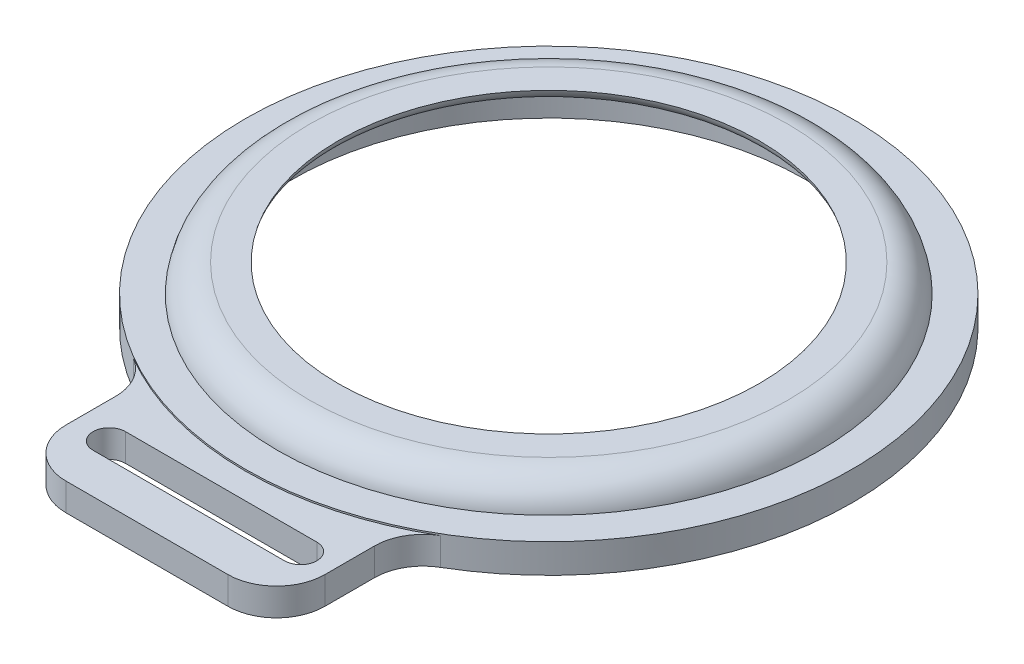
ISO-10303-21;
HEADER;
FILE_DESCRIPTION(('STEP AP214'),'2;1');
FILE_NAME('part.step','',(''),(''),'','','');
FILE_SCHEMA(('AUTOMOTIVE_DESIGN { 1 0 10303 214 1 1 1 1 }'));
ENDSEC;
DATA;
#1=APPLICATION_CONTEXT('core data for automotive mechanical design processes');
#2=APPLICATION_PROTOCOL_DEFINITION('international standard','automotive_design',2000,#1);
#3=PRODUCT_CONTEXT('',#1,'mechanical');
#4=PRODUCT('Part','Part','',(#3));
#5=PRODUCT_RELATED_PRODUCT_CATEGORY('part','',(#4));
#6=PRODUCT_DEFINITION_FORMATION('','',#4);
#7=PRODUCT_DEFINITION_CONTEXT('part definition',#1,'design');
#8=PRODUCT_DEFINITION('design','',#6,#7);
#9=PRODUCT_DEFINITION_SHAPE('','',#8);
#10=(LENGTH_UNIT() NAMED_UNIT(*) SI_UNIT(.MILLI.,.METRE.));
#11=(NAMED_UNIT(*) PLANE_ANGLE_UNIT() SI_UNIT($,.RADIAN.));
#12=(NAMED_UNIT(*) SI_UNIT($,.STERADIAN.) SOLID_ANGLE_UNIT());
#13=UNCERTAINTY_MEASURE_WITH_UNIT(LENGTH_MEASURE(1.E-05),#10,'distance_accuracy_value','');
#14=(GEOMETRIC_REPRESENTATION_CONTEXT(3) GLOBAL_UNCERTAINTY_ASSIGNED_CONTEXT((#13)) GLOBAL_UNIT_ASSIGNED_CONTEXT((#10,
#11,#12)) REPRESENTATION_CONTEXT('',''));
#15=CARTESIAN_POINT('',(0.,0.,0.));
#16=DIRECTION('',(0.,0.,1.));
#17=DIRECTION('',(1.,0.,0.));
#18=AXIS2_PLACEMENT_3D('',#15,#16,#17);
#19=CARTESIAN_POINT('',(0.,1.8,0.));
#20=DIRECTION('',(0.,-1.,0.));
#21=DIRECTION('',(0.,0.,-1.));
#22=AXIS2_PLACEMENT_3D('',#19,#20,#21);
#23=CYLINDRICAL_SURFACE('',#22,18.75);
#24=CARTESIAN_POINT('',(0.,1.8,0.));
#25=DIRECTION('',(0.,1.,0.));
#26=DIRECTION('',(0.,0.,1.));
#27=AXIS2_PLACEMENT_3D('',#24,#25,#26);
#28=CIRCLE('',#27,18.75);
#29=CARTESIAN_POINT('',(0.,1.8,18.75));
#30=VERTEX_POINT('',#29);
#31=EDGE_CURVE('E246',#30,#30,#28,.T.);
#32=ORIENTED_EDGE('',*,*,#31,.F.);
#33=EDGE_LOOP('',(#32));
#34=FACE_BOUND('',#33,.T.);
#35=DIRECTION('',(0.,-1.,0.));
#36=VECTOR('',#35,1.);
#37=CARTESIAN_POINT('',(-9.48275862068967,1.7,16.17528327238));
#38=LINE('',#37,#36);
#39=CARTESIAN_POINT('',(-9.48275862068965,1.7,16.17528327238));
#40=VERTEX_POINT('',#39);
#41=CARTESIAN_POINT('',(-9.48275862068967,0.,16.17528327238));
#42=VERTEX_POINT('',#41);
#43=EDGE_CURVE('E66',#40,#42,#38,.T.);
#44=ORIENTED_EDGE('',*,*,#43,.F.);
#45=CARTESIAN_POINT('',(0.,1.7,0.));
#46=DIRECTION('',(0.,1.,0.));
#47=DIRECTION('',(0.,0.,1.));
#48=AXIS2_PLACEMENT_3D('',#45,#46,#47);
#49=CIRCLE('',#48,18.75);
#50=CARTESIAN_POINT('',(9.48275862068965,1.7,16.17528327238));
#51=VERTEX_POINT('',#50);
#52=EDGE_CURVE('E61',#40,#51,#49,.T.);
#53=ORIENTED_EDGE('',*,*,#52,.T.);
#54=DIRECTION('',(0.,-1.,0.));
#55=VECTOR('',#54,1.);
#56=CARTESIAN_POINT('',(9.48275862068965,1.7,16.17528327238));
#57=LINE('',#56,#55);
#58=CARTESIAN_POINT('',(9.48275862068965,0.,16.17528327238));
#59=VERTEX_POINT('',#58);
#60=EDGE_CURVE('E233',#51,#59,#57,.T.);
#61=ORIENTED_EDGE('',*,*,#60,.T.);
#62=CARTESIAN_POINT('',(0.,0.,0.));
#63=DIRECTION('',(0.,1.,0.));
#64=DIRECTION('',(0.,0.,1.));
#65=AXIS2_PLACEMENT_3D('',#62,#63,#64);
#66=CIRCLE('',#65,18.75);
#67=EDGE_CURVE('E241',#59,#42,#66,.T.);
#68=ORIENTED_EDGE('',*,*,#67,.T.);
#69=EDGE_LOOP('',(#44,#53,#61,#68));
#70=FACE_BOUND('',#69,.T.);
#71=ADVANCED_FACE('F46',(#34,#70),#23,.T.);
#72=CARTESIAN_POINT('',(0.,1.8,0.));
#73=DIRECTION('',(0.,1.,0.));
#74=DIRECTION('',(0.,0.,1.));
#75=AXIS2_PLACEMENT_3D('',#72,#73,#74);
#76=PLANE('',#75);
#77=CARTESIAN_POINT('',(0.,1.8,0.));
#78=DIRECTION('',(0.,1.,0.));
#79=DIRECTION('',(0.,0.,1.));
#80=AXIS2_PLACEMENT_3D('',#77,#78,#79);
#81=CIRCLE('',#80,16.75);
#82=CARTESIAN_POINT('',(0.,1.8,16.75));
#83=VERTEX_POINT('',#82);
#84=EDGE_CURVE('E242',#83,#83,#81,.T.);
#85=ORIENTED_EDGE('',*,*,#84,.F.);
#86=EDGE_LOOP('',(#85));
#87=FACE_BOUND('',#86,.T.);
#88=ORIENTED_EDGE('',*,*,#31,.T.);
#89=EDGE_LOOP('',(#88));
#90=FACE_BOUND('',#89,.T.);
#91=ADVANCED_FACE('F274',(#87,#90),#76,.T.);
#92=CARTESIAN_POINT('',(0.,0.,0.));
#93=DIRECTION('',(0.,1.,0.));
#94=DIRECTION('',(0.,0.,1.));
#95=AXIS2_PLACEMENT_3D('',#92,#93,#94);
#96=PLANE('',#95);
#97=CARTESIAN_POINT('',(0.,0.,0.));
#98=DIRECTION('',(0.,-1.,0.));
#99=DIRECTION('',(0.,0.,-1.));
#100=AXIS2_PLACEMENT_3D('',#97,#98,#99);
#101=CIRCLE('',#100,15.85);
#102=CARTESIAN_POINT('',(0.,0.,-15.85));
#103=VERTEX_POINT('',#102);
#104=EDGE_CURVE('E222',#103,#103,#101,.T.);
#105=ORIENTED_EDGE('',*,*,#104,.F.);
#106=EDGE_LOOP('',(#105));
#107=FACE_BOUND('',#106,.T.);
#108=ORIENTED_EDGE('',*,*,#67,.F.);
#109=CARTESIAN_POINT('',(11.,0.,18.7633285959608));
#110=DIRECTION('',(0.,1.,0.));
#111=DIRECTION('',(0.,0.,-1.));
#112=AXIS2_PLACEMENT_3D('',#109,#110,#111);
#113=CIRCLE('',#112,3.);
#114=CARTESIAN_POINT('',(8.,0.,18.7633285959608));
#115=VERTEX_POINT('',#114);
#116=EDGE_CURVE('E203',#59,#115,#113,.T.);
#117=ORIENTED_EDGE('',*,*,#116,.T.);
#118=DIRECTION('',(0.,0.,1.));
#119=VECTOR('',#118,1.);
#120=CARTESIAN_POINT('',(8.,0.,18.7633285959608));
#121=LINE('',#120,#119);
#122=CARTESIAN_POINT('',(8.,0.,21.8205761301468));
#123=VERTEX_POINT('',#122);
#124=EDGE_CURVE('E206',#115,#123,#121,.T.);
#125=ORIENTED_EDGE('',*,*,#124,.T.);
#126=CARTESIAN_POINT('',(5.,0.,21.8205761301468));
#127=DIRECTION('',(0.,-1.,0.));
#128=DIRECTION('',(0.,0.,1.));
#129=AXIS2_PLACEMENT_3D('',#126,#127,#128);
#130=CIRCLE('',#129,3.);
#131=CARTESIAN_POINT('',(4.99999999999998,0.,24.8205761301468));
#132=VERTEX_POINT('',#131);
#133=EDGE_CURVE('E209',#123,#132,#130,.T.);
#134=ORIENTED_EDGE('',*,*,#133,.T.);
#135=DIRECTION('',(-1.,0.,0.));
#136=VECTOR('',#135,1.);
#137=CARTESIAN_POINT('',(-4.99999999999998,0.,24.8205761301468));
#138=LINE('',#137,#136);
#139=CARTESIAN_POINT('',(-5.,0.,24.8205761301468));
#140=VERTEX_POINT('',#139);
#141=EDGE_CURVE('E212',#132,#140,#138,.T.);
#142=ORIENTED_EDGE('',*,*,#141,.T.);
#143=CARTESIAN_POINT('',(-5.,0.,21.8205761301468));
#144=DIRECTION('',(0.,-1.,0.));
#145=DIRECTION('',(0.,0.,1.));
#146=AXIS2_PLACEMENT_3D('',#143,#144,#145);
#147=CIRCLE('',#146,3.);
#148=CARTESIAN_POINT('',(-8.,0.,21.8205761301468));
#149=VERTEX_POINT('',#148);
#150=EDGE_CURVE('E215',#140,#149,#147,.T.);
#151=ORIENTED_EDGE('',*,*,#150,.T.);
#152=DIRECTION('',(0.,0.,-1.));
#153=VECTOR('',#152,1.);
#154=CARTESIAN_POINT('',(-8.,0.,18.7633285959608));
#155=LINE('',#154,#153);
#156=CARTESIAN_POINT('',(-8.,0.,18.7633285959608));
#157=VERTEX_POINT('',#156);
#158=EDGE_CURVE('E181',#149,#157,#155,.T.);
#159=ORIENTED_EDGE('',*,*,#158,.T.);
#160=CARTESIAN_POINT('',(-11.,0.,18.7633285959608));
#161=DIRECTION('',(0.,1.,0.));
#162=DIRECTION('',(0.,0.,1.));
#163=AXIS2_PLACEMENT_3D('',#160,#161,#162);
#164=CIRCLE('',#163,3.);
#165=EDGE_CURVE('E174',#157,#42,#164,.T.);
#166=ORIENTED_EDGE('',*,*,#165,.T.);
#167=EDGE_LOOP('',(#108,#117,#125,#134,#142,#151,#159,#166));
#168=FACE_BOUND('',#167,.T.);
#169=DIRECTION('',(1.,0.,0.));
#170=VECTOR('',#169,1.);
#171=CARTESIAN_POINT('',(-5.80848947053036,0.,20.338127716561));
#172=LINE('',#171,#170);
#173=CARTESIAN_POINT('',(-5.80848947053036,0.,20.338127716561));
#174=VERTEX_POINT('',#173);
#175=CARTESIAN_POINT('',(6.01588711501888,0.,20.338127716561));
#176=VERTEX_POINT('',#175);
#177=EDGE_CURVE('E168',#174,#176,#172,.T.);
#178=ORIENTED_EDGE('',*,*,#177,.F.);
#179=CARTESIAN_POINT('',(-5.80848947053036,0.,21.338127716561));
#180=DIRECTION('',(0.,-1.,0.));
#181=DIRECTION('',(0.,0.,-1.));
#182=AXIS2_PLACEMENT_3D('',#179,#180,#181);
#183=CIRCLE('',#182,1.);
#184=CARTESIAN_POINT('',(-5.80848947053036,0.,22.338127716561));
#185=VERTEX_POINT('',#184);
#186=EDGE_CURVE('E141',#185,#174,#183,.T.);
#187=ORIENTED_EDGE('',*,*,#186,.F.);
#188=DIRECTION('',(-1.,0.,0.));
#189=VECTOR('',#188,1.);
#190=CARTESIAN_POINT('',(-5.80848947053036,0.,22.338127716561));
#191=LINE('',#190,#189);
#192=CARTESIAN_POINT('',(6.01588711501888,0.,22.338127716561));
#193=VERTEX_POINT('',#192);
#194=EDGE_CURVE('E159',#193,#185,#191,.T.);
#195=ORIENTED_EDGE('',*,*,#194,.F.);
#196=CARTESIAN_POINT('',(6.01588711501888,0.,21.338127716561));
#197=DIRECTION('',(0.,-1.,0.));
#198=DIRECTION('',(0.,0.,-1.));
#199=AXIS2_PLACEMENT_3D('',#196,#197,#198);
#200=CIRCLE('',#199,1.);
#201=EDGE_CURVE('E162',#176,#193,#200,.T.);
#202=ORIENTED_EDGE('',*,*,#201,.F.);
#203=EDGE_LOOP('',(#178,#187,#195,#202));
#204=FACE_BOUND('',#203,.T.);
#205=ADVANCED_FACE('F280',(#107,#168,#204),#96,.F.);
#206=CARTESIAN_POINT('',(0.,3.5,0.));
#207=DIRECTION('',(0.,1.,0.));
#208=DIRECTION('',(0.,0.,1.));
#209=AXIS2_PLACEMENT_3D('',#206,#207,#208);
#210=PLANE('',#209);
#211=CARTESIAN_POINT('',(0.,3.5,0.));
#212=DIRECTION('',(0.,1.,0.));
#213=DIRECTION('',(0.,0.,1.));
#214=AXIS2_PLACEMENT_3D('',#211,#212,#213);
#215=CIRCLE('',#214,14.7726280066715);
#216=CARTESIAN_POINT('',(0.,3.5,14.7726280066715));
#217=VERTEX_POINT('',#216);
#218=EDGE_CURVE('E245',#217,#217,#215,.T.);
#219=ORIENTED_EDGE('',*,*,#218,.T.);
#220=EDGE_LOOP('',(#219));
#221=FACE_BOUND('',#220,.T.);
#222=CARTESIAN_POINT('',(0.,3.5,0.));
#223=DIRECTION('',(0.,1.,0.));
#224=DIRECTION('',(0.,0.,1.));
#225=AXIS2_PLACEMENT_3D('',#222,#223,#224);
#226=CIRCLE('',#225,13.);
#227=CARTESIAN_POINT('',(0.,3.5,13.));
#228=VERTEX_POINT('',#227);
#229=EDGE_CURVE('E238',#228,#228,#226,.T.);
#230=ORIENTED_EDGE('',*,*,#229,.F.);
#231=EDGE_LOOP('',(#230));
#232=FACE_BOUND('',#231,.T.);
#233=ADVANCED_FACE('F287',(#221,#232),#210,.T.);
#234=CARTESIAN_POINT('',(0.,1.5,0.));
#235=DIRECTION('',(0.,-1.,0.));
#236=DIRECTION('',(0.,0.,-1.));
#237=AXIS2_PLACEMENT_3D('',#234,#235,#236);
#238=TOROIDAL_SURFACE('',#237,14.7726280066715,2.);
#239=ORIENTED_EDGE('',*,*,#84,.T.);
#240=EDGE_LOOP('',(#239));
#241=FACE_BOUND('',#240,.T.);
#242=ORIENTED_EDGE('',*,*,#218,.F.);
#243=EDGE_LOOP('',(#242));
#244=FACE_BOUND('',#243,.T.);
#245=ADVANCED_FACE('F285',(#241,#244),#238,.T.);
#246=CARTESIAN_POINT('',(0.,2.7,0.));
#247=DIRECTION('',(0.,-1.,0.));
#248=DIRECTION('',(0.,0.,-1.));
#249=AXIS2_PLACEMENT_3D('',#246,#247,#248);
#250=PLANE('',#249);
#251=CARTESIAN_POINT('',(0.,2.7,0.));
#252=DIRECTION('',(0.,-1.,0.));
#253=DIRECTION('',(0.,0.,-1.));
#254=AXIS2_PLACEMENT_3D('',#251,#252,#253);
#255=CIRCLE('',#254,13.9797958971133);
#256=CARTESIAN_POINT('',(0.,2.7,-13.9797958971133));
#257=VERTEX_POINT('',#256);
#258=EDGE_CURVE('E54',#257,#257,#255,.F.);
#259=ORIENTED_EDGE('',*,*,#258,.T.);
#260=EDGE_LOOP('',(#259));
#261=FACE_BOUND('',#260,.T.);
#262=CARTESIAN_POINT('',(0.,2.7,0.));
#263=DIRECTION('',(0.,-1.,0.));
#264=DIRECTION('',(0.,0.,-1.));
#265=AXIS2_PLACEMENT_3D('',#262,#263,#264);
#266=CIRCLE('',#265,14.85);
#267=CARTESIAN_POINT('',(0.,2.7,-14.85));
#268=VERTEX_POINT('',#267);
#269=EDGE_CURVE('E252',#268,#268,#266,.T.);
#270=ORIENTED_EDGE('',*,*,#269,.T.);
#271=EDGE_LOOP('',(#270));
#272=FACE_BOUND('',#271,.T.);
#273=ADVANCED_FACE('F257',(#261,#272),#250,.T.);
#274=CARTESIAN_POINT('',(0.,2.7,0.));
#275=DIRECTION('',(0.,-1.,0.));
#276=DIRECTION('',(0.,0.,-1.));
#277=AXIS2_PLACEMENT_3D('',#274,#275,#276);
#278=CYLINDRICAL_SURFACE('',#277,15.85);
#279=CARTESIAN_POINT('',(0.,1.7,0.));
#280=DIRECTION('',(0.,-1.,0.));
#281=DIRECTION('',(0.,0.,-1.));
#282=AXIS2_PLACEMENT_3D('',#279,#280,#281);
#283=CIRCLE('',#282,15.85);
#284=CARTESIAN_POINT('',(0.,1.7,-15.85));
#285=VERTEX_POINT('',#284);
#286=EDGE_CURVE('E13',#285,#285,#283,.F.);
#287=CARTESIAN_POINT('',(0.,1.7,-15.85));
#288=CARTESIAN_POINT('',(0.,1.68229166666667,-15.85));
#289=CARTESIAN_POINT('',(0.,1.66458333333333,-15.85));
#290=CARTESIAN_POINT('',(0.,1.62916666666667,-15.85));
#291=CARTESIAN_POINT('',(0.,1.61145833333333,-15.85));
#292=CARTESIAN_POINT('',(0.,1.57604166666667,-15.85));
#293=CARTESIAN_POINT('',(0.,1.55833333333333,-15.85));
#294=CARTESIAN_POINT('',(0.,1.52291666666667,-15.85));
#295=CARTESIAN_POINT('',(0.,1.50520833333333,-15.85));
#296=CARTESIAN_POINT('',(0.,1.46979166666667,-15.85));
#297=CARTESIAN_POINT('',(0.,1.45208333333333,-15.85));
#298=CARTESIAN_POINT('',(0.,1.41666666666667,-15.85));
#299=CARTESIAN_POINT('',(0.,1.39895833333333,-15.85));
#300=CARTESIAN_POINT('',(0.,1.36354166666667,-15.85));
#301=CARTESIAN_POINT('',(0.,1.34583333333333,-15.85));
#302=CARTESIAN_POINT('',(0.,1.31041666666667,-15.85));
#303=CARTESIAN_POINT('',(0.,1.29270833333333,-15.85));
#304=CARTESIAN_POINT('',(0.,1.25729166666667,-15.85));
#305=CARTESIAN_POINT('',(0.,1.23958333333333,-15.85));
#306=CARTESIAN_POINT('',(0.,1.20416666666667,-15.85));
#307=CARTESIAN_POINT('',(0.,1.18645833333333,-15.85));
#308=CARTESIAN_POINT('',(0.,1.15104166666667,-15.85));
#309=CARTESIAN_POINT('',(0.,1.13333333333333,-15.85));
#310=CARTESIAN_POINT('',(0.,1.09791666666667,-15.85));
#311=CARTESIAN_POINT('',(0.,1.08020833333333,-15.85));
#312=CARTESIAN_POINT('',(0.,1.04479166666667,-15.85));
#313=CARTESIAN_POINT('',(0.,1.02708333333333,-15.85));
#314=CARTESIAN_POINT('',(0.,0.991666666666667,-15.85));
#315=CARTESIAN_POINT('',(0.,0.973958333333334,-15.85));
#316=CARTESIAN_POINT('',(0.,0.938541666666667,-15.85));
#317=CARTESIAN_POINT('',(0.,0.920833333333334,-15.85));
#318=CARTESIAN_POINT('',(0.,0.885416666666667,-15.85));
#319=CARTESIAN_POINT('',(0.,0.867708333333334,-15.85));
#320=CARTESIAN_POINT('',(0.,0.832291666666667,-15.85));
#321=CARTESIAN_POINT('',(0.,0.814583333333334,-15.85));
#322=CARTESIAN_POINT('',(0.,0.779166666666667,-15.85));
#323=CARTESIAN_POINT('',(0.,0.761458333333334,-15.85));
#324=CARTESIAN_POINT('',(0.,0.726041666666667,-15.85));
#325=CARTESIAN_POINT('',(0.,0.708333333333334,-15.85));
#326=CARTESIAN_POINT('',(0.,0.672916666666667,-15.85));
#327=CARTESIAN_POINT('',(0.,0.655208333333334,-15.85));
#328=CARTESIAN_POINT('',(0.,0.619791666666667,-15.85));
#329=CARTESIAN_POINT('',(0.,0.602083333333334,-15.85));
#330=CARTESIAN_POINT('',(0.,0.566666666666667,-15.85));
#331=CARTESIAN_POINT('',(0.,0.548958333333334,-15.85));
#332=CARTESIAN_POINT('',(0.,0.513541666666667,-15.85));
#333=CARTESIAN_POINT('',(0.,0.495833333333334,-15.85));
#334=CARTESIAN_POINT('',(0.,0.460416666666667,-15.85));
#335=CARTESIAN_POINT('',(0.,0.442708333333334,-15.85));
#336=CARTESIAN_POINT('',(0.,0.407291666666667,-15.85));
#337=CARTESIAN_POINT('',(0.,0.389583333333334,-15.85));
#338=CARTESIAN_POINT('',(0.,0.354166666666667,-15.85));
#339=CARTESIAN_POINT('',(0.,0.336458333333334,-15.85));
#340=CARTESIAN_POINT('',(0.,0.301041666666667,-15.85));
#341=CARTESIAN_POINT('',(0.,0.283333333333334,-15.85));
#342=CARTESIAN_POINT('',(0.,0.247916666666667,-15.85));
#343=CARTESIAN_POINT('',(0.,0.230208333333334,-15.85));
#344=CARTESIAN_POINT('',(0.,0.194791666666667,-15.85));
#345=CARTESIAN_POINT('',(0.,0.177083333333334,-15.85));
#346=CARTESIAN_POINT('',(0.,0.141666666666667,-15.85));
#347=CARTESIAN_POINT('',(0.,0.123958333333334,-15.85));
#348=CARTESIAN_POINT('',(0.,0.0885416666666672,-15.85));
#349=CARTESIAN_POINT('',(0.,0.0708333333333339,-15.85));
#350=CARTESIAN_POINT('',(0.,0.0354166666666672,-15.85));
#351=CARTESIAN_POINT('',(0.,0.0177083333333338,-15.85));
#352=CARTESIAN_POINT('',(0.,0.,-15.85));
#353=B_SPLINE_CURVE_WITH_KNOTS('',3,(#287,#288,#289,#290,#291,#292,#293,#294,#295,#296,#297,
#298,#299,#300,#301,#302,#303,#304,#305,#306,#307,#308,#309,#310,#311,#312,#313,#314,#315,#316,
#317,#318,#319,#320,#321,#322,#323,#324,#325,#326,#327,#328,#329,#330,#331,#332,#333,#334,#335,
#336,#337,#338,#339,#340,#341,#342,#343,#344,#345,#346,#347,#348,#349,#350,#351,#352),
.UNSPECIFIED.,.F.,.F.,(4,2,2,2,2,2,2,2,2,2,2,2,2,2,2,2,2,2,2,2,2,2,2,2,2,2,2,2,2,2,2,2,4),(0.,
0.053125,0.10625,0.159375,0.2125,0.265625,0.31875,0.371875,0.425,0.478125,0.53125,0.584375,
0.6375,0.690625,0.74375,0.796875,0.85,0.903125,0.95625,1.009375,1.0625,1.115625,1.16875,
1.221875,1.275,1.328125,1.38125,1.434375,1.4875,1.540625,1.59375,1.646875,1.7),.UNSPECIFIED.);
#354=EDGE_CURVE('BSEAM262',#285,#103,#353,.T.);
#355=ORIENTED_EDGE('',*,*,#286,.T.);
#356=ORIENTED_EDGE('',*,*,#104,.T.);
#357=ORIENTED_EDGE('',*,*,#354,.T.);
#358=ORIENTED_EDGE('',*,*,#354,.F.);
#359=EDGE_LOOP('',(#355,#357,#356,#358));
#360=FACE_BOUND('',#359,.T.);
#361=ADVANCED_FACE('F262',(#360),#278,.F.);
#362=CARTESIAN_POINT('',(0.,3.7,0.));
#363=DIRECTION('',(0.,-1.,0.));
#364=DIRECTION('',(0.,0.,-1.));
#365=AXIS2_PLACEMENT_3D('',#362,#363,#364);
#366=TOROIDAL_SURFACE('',#365,13.9797958971133,1.);
#367=ORIENTED_EDGE('',*,*,#229,.T.);
#368=EDGE_LOOP('',(#367));
#369=FACE_BOUND('',#368,.T.);
#370=ORIENTED_EDGE('',*,*,#258,.F.);
#371=EDGE_LOOP('',(#370));
#372=FACE_BOUND('',#371,.T.);
#373=ADVANCED_FACE('F260',(#369,#372),#366,.T.);
#374=CARTESIAN_POINT('',(0.,1.7,0.));
#375=DIRECTION('',(0.,-1.,0.));
#376=DIRECTION('',(0.,0.,-1.));
#377=AXIS2_PLACEMENT_3D('',#374,#375,#376);
#378=TOROIDAL_SURFACE('',#377,14.85,1.);
#379=ORIENTED_EDGE('',*,*,#286,.F.);
#380=EDGE_LOOP('',(#379));
#381=FACE_BOUND('',#380,.T.);
#382=ORIENTED_EDGE('',*,*,#269,.F.);
#383=EDGE_LOOP('',(#382));
#384=FACE_BOUND('',#383,.T.);
#385=ADVANCED_FACE('F48',(#381,#384),#378,.F.);
#386=CARTESIAN_POINT('',(-11.,1.7,18.7633285959608));
#387=DIRECTION('',(0.,-1.,0.));
#388=DIRECTION('',(0.,0.,-1.));
#389=AXIS2_PLACEMENT_3D('',#386,#387,#388);
#390=CYLINDRICAL_SURFACE('',#389,3.);
#391=ORIENTED_EDGE('',*,*,#165,.F.);
#392=DIRECTION('',(0.,-1.,0.));
#393=VECTOR('',#392,1.);
#394=CARTESIAN_POINT('',(-8.,1.7,18.7633285959608));
#395=LINE('',#394,#393);
#396=CARTESIAN_POINT('',(-8.,1.7,18.7633285959608));
#397=VERTEX_POINT('',#396);
#398=EDGE_CURVE('E220',#397,#157,#395,.T.);
#399=ORIENTED_EDGE('',*,*,#398,.F.);
#400=CARTESIAN_POINT('',(-11.,1.7,18.7633285959608));
#401=DIRECTION('',(0.,1.,0.));
#402=DIRECTION('',(0.,0.,1.));
#403=AXIS2_PLACEMENT_3D('',#400,#401,#402);
#404=CIRCLE('',#403,3.);
#405=EDGE_CURVE('E178',#397,#40,#404,.T.);
#406=ORIENTED_EDGE('',*,*,#405,.T.);
#407=ORIENTED_EDGE('',*,*,#43,.T.);
#408=EDGE_LOOP('',(#391,#399,#406,#407));
#409=FACE_BOUND('',#408,.T.);
#410=ADVANCED_FACE('F268',(#409),#390,.F.);
#411=CARTESIAN_POINT('',(-8.,1.7,18.7633285959608));
#412=DIRECTION('',(-1.,0.,0.));
#413=DIRECTION('',(0.,0.,1.));
#414=AXIS2_PLACEMENT_3D('',#411,#412,#413);
#415=PLANE('',#414);
#416=ORIENTED_EDGE('',*,*,#158,.F.);
#417=DIRECTION('',(0.,-1.,0.));
#418=VECTOR('',#417,1.);
#419=CARTESIAN_POINT('',(-8.,1.7,21.8205761301468));
#420=LINE('',#419,#418);
#421=CARTESIAN_POINT('',(-8.,1.7,21.8205761301468));
#422=VERTEX_POINT('',#421);
#423=EDGE_CURVE('E223',#422,#149,#420,.T.);
#424=ORIENTED_EDGE('',*,*,#423,.F.);
#425=DIRECTION('',(0.,0.,-1.));
#426=VECTOR('',#425,1.);
#427=CARTESIAN_POINT('',(-8.,1.7,18.7633285959608));
#428=LINE('',#427,#426);
#429=EDGE_CURVE('E198',#422,#397,#428,.T.);
#430=ORIENTED_EDGE('',*,*,#429,.T.);
#431=ORIENTED_EDGE('',*,*,#398,.T.);
#432=EDGE_LOOP('',(#416,#424,#430,#431));
#433=FACE_BOUND('',#432,.T.);
#434=ADVANCED_FACE('F309',(#433),#415,.T.);
#435=CARTESIAN_POINT('',(-5.,1.7,21.8205761301468));
#436=DIRECTION('',(0.,-1.,0.));
#437=DIRECTION('',(0.,0.,-1.));
#438=AXIS2_PLACEMENT_3D('',#435,#436,#437);
#439=CYLINDRICAL_SURFACE('',#438,3.);
#440=ORIENTED_EDGE('',*,*,#150,.F.);
#441=DIRECTION('',(0.,-1.,0.));
#442=VECTOR('',#441,1.);
#443=CARTESIAN_POINT('',(-5.,1.7,24.8205761301468));
#444=LINE('',#443,#442);
#445=CARTESIAN_POINT('',(-5.,1.7,24.8205761301468));
#446=VERTEX_POINT('',#445);
#447=EDGE_CURVE('E225',#446,#140,#444,.T.);
#448=ORIENTED_EDGE('',*,*,#447,.F.);
#449=CARTESIAN_POINT('',(-5.,1.7,21.8205761301468));
#450=DIRECTION('',(0.,-1.,0.));
#451=DIRECTION('',(0.,0.,1.));
#452=AXIS2_PLACEMENT_3D('',#449,#450,#451);
#453=CIRCLE('',#452,3.);
#454=EDGE_CURVE('E195',#446,#422,#453,.T.);
#455=ORIENTED_EDGE('',*,*,#454,.T.);
#456=ORIENTED_EDGE('',*,*,#423,.T.);
#457=EDGE_LOOP('',(#440,#448,#455,#456));
#458=FACE_BOUND('',#457,.T.);
#459=ADVANCED_FACE('F326',(#458),#439,.T.);
#460=CARTESIAN_POINT('',(-4.99999999999998,1.7,24.8205761301468));
#461=DIRECTION('',(0.,0.,1.));
#462=DIRECTION('',(1.,0.,0.));
#463=AXIS2_PLACEMENT_3D('',#460,#461,#462);
#464=PLANE('',#463);
#465=ORIENTED_EDGE('',*,*,#141,.F.);
#466=DIRECTION('',(0.,-1.,0.));
#467=VECTOR('',#466,1.);
#468=CARTESIAN_POINT('',(4.99999999999998,1.7,24.8205761301468));
#469=LINE('',#468,#467);
#470=CARTESIAN_POINT('',(4.99999999999998,1.7,24.8205761301468));
#471=VERTEX_POINT('',#470);
#472=EDGE_CURVE('E227',#471,#132,#469,.T.);
#473=ORIENTED_EDGE('',*,*,#472,.F.);
#474=DIRECTION('',(-1.,0.,0.));
#475=VECTOR('',#474,1.);
#476=CARTESIAN_POINT('',(-4.99999999999998,1.7,24.8205761301468));
#477=LINE('',#476,#475);
#478=EDGE_CURVE('E192',#471,#446,#477,.T.);
#479=ORIENTED_EDGE('',*,*,#478,.T.);
#480=ORIENTED_EDGE('',*,*,#447,.T.);
#481=EDGE_LOOP('',(#465,#473,#479,#480));
#482=FACE_BOUND('',#481,.T.);
#483=ADVANCED_FACE('F322',(#482),#464,.T.);
#484=CARTESIAN_POINT('',(5.,1.7,21.8205761301468));
#485=DIRECTION('',(0.,-1.,0.));
#486=DIRECTION('',(0.,0.,-1.));
#487=AXIS2_PLACEMENT_3D('',#484,#485,#486);
#488=CYLINDRICAL_SURFACE('',#487,3.);
#489=ORIENTED_EDGE('',*,*,#133,.F.);
#490=DIRECTION('',(0.,-1.,0.));
#491=VECTOR('',#490,1.);
#492=CARTESIAN_POINT('',(8.,1.7,21.8205761301468));
#493=LINE('',#492,#491);
#494=CARTESIAN_POINT('',(8.,1.7,21.8205761301468));
#495=VERTEX_POINT('',#494);
#496=EDGE_CURVE('E229',#495,#123,#493,.T.);
#497=ORIENTED_EDGE('',*,*,#496,.F.);
#498=CARTESIAN_POINT('',(5.,1.7,21.8205761301468));
#499=DIRECTION('',(0.,-1.,0.));
#500=DIRECTION('',(0.,0.,1.));
#501=AXIS2_PLACEMENT_3D('',#498,#499,#500);
#502=CIRCLE('',#501,3.);
#503=EDGE_CURVE('E189',#495,#471,#502,.T.);
#504=ORIENTED_EDGE('',*,*,#503,.T.);
#505=ORIENTED_EDGE('',*,*,#472,.T.);
#506=EDGE_LOOP('',(#489,#497,#504,#505));
#507=FACE_BOUND('',#506,.T.);
#508=ADVANCED_FACE('F318',(#507),#488,.T.);
#509=CARTESIAN_POINT('',(8.,1.7,18.7633285959608));
#510=DIRECTION('',(1.,0.,0.));
#511=DIRECTION('',(0.,0.,-1.));
#512=AXIS2_PLACEMENT_3D('',#509,#510,#511);
#513=PLANE('',#512);
#514=ORIENTED_EDGE('',*,*,#124,.F.);
#515=DIRECTION('',(0.,-1.,0.));
#516=VECTOR('',#515,1.);
#517=CARTESIAN_POINT('',(8.,1.7,18.7633285959608));
#518=LINE('',#517,#516);
#519=CARTESIAN_POINT('',(8.,1.7,18.7633285959608));
#520=VERTEX_POINT('',#519);
#521=EDGE_CURVE('E231',#520,#115,#518,.T.);
#522=ORIENTED_EDGE('',*,*,#521,.F.);
#523=DIRECTION('',(0.,0.,1.));
#524=VECTOR('',#523,1.);
#525=CARTESIAN_POINT('',(8.,1.7,18.7633285959608));
#526=LINE('',#525,#524);
#527=EDGE_CURVE('E186',#520,#495,#526,.T.);
#528=ORIENTED_EDGE('',*,*,#527,.T.);
#529=ORIENTED_EDGE('',*,*,#496,.T.);
#530=EDGE_LOOP('',(#514,#522,#528,#529));
#531=FACE_BOUND('',#530,.T.);
#532=ADVANCED_FACE('F314',(#531),#513,.T.);
#533=CARTESIAN_POINT('',(11.,1.7,18.7633285959608));
#534=DIRECTION('',(0.,-1.,0.));
#535=DIRECTION('',(0.,0.,-1.));
#536=AXIS2_PLACEMENT_3D('',#533,#534,#535);
#537=CYLINDRICAL_SURFACE('',#536,3.);
#538=ORIENTED_EDGE('',*,*,#116,.F.);
#539=ORIENTED_EDGE('',*,*,#60,.F.);
#540=CARTESIAN_POINT('',(11.,1.7,18.7633285959608));
#541=DIRECTION('',(0.,1.,0.));
#542=DIRECTION('',(0.,0.,-1.));
#543=AXIS2_PLACEMENT_3D('',#540,#541,#542);
#544=CIRCLE('',#543,3.);
#545=EDGE_CURVE('E183',#51,#520,#544,.T.);
#546=ORIENTED_EDGE('',*,*,#545,.T.);
#547=ORIENTED_EDGE('',*,*,#521,.T.);
#548=EDGE_LOOP('',(#538,#539,#546,#547));
#549=FACE_BOUND('',#548,.T.);
#550=ADVANCED_FACE('F311',(#549),#537,.F.);
#551=CARTESIAN_POINT('',(-11.,1.7,18.7633285959608));
#552=DIRECTION('',(0.,1.,0.));
#553=DIRECTION('',(0.,0.,1.));
#554=AXIS2_PLACEMENT_3D('',#551,#552,#553);
#555=PLANE('',#554);
#556=CARTESIAN_POINT('',(-5.80848947053036,1.7,21.338127716561));
#557=DIRECTION('',(0.,-1.,0.));
#558=DIRECTION('',(0.,0.,-1.));
#559=AXIS2_PLACEMENT_3D('',#556,#557,#558);
#560=CIRCLE('',#559,1.);
#561=CARTESIAN_POINT('',(-5.80848947053036,1.7,22.338127716561));
#562=VERTEX_POINT('',#561);
#563=CARTESIAN_POINT('',(-5.80848947053036,1.7,20.338127716561));
#564=VERTEX_POINT('',#563);
#565=EDGE_CURVE('E138',#562,#564,#560,.T.);
#566=ORIENTED_EDGE('',*,*,#565,.T.);
#567=DIRECTION('',(1.,0.,0.));
#568=VECTOR('',#567,1.);
#569=CARTESIAN_POINT('',(-5.80848947053036,1.7,20.338127716561));
#570=LINE('',#569,#568);
#571=CARTESIAN_POINT('',(6.01588711501888,1.7,20.338127716561));
#572=VERTEX_POINT('',#571);
#573=EDGE_CURVE('E150',#564,#572,#570,.T.);
#574=ORIENTED_EDGE('',*,*,#573,.T.);
#575=CARTESIAN_POINT('',(6.01588711501888,1.7,21.338127716561));
#576=DIRECTION('',(0.,-1.,0.));
#577=DIRECTION('',(0.,0.,-1.));
#578=AXIS2_PLACEMENT_3D('',#575,#576,#577);
#579=CIRCLE('',#578,1.);
#580=CARTESIAN_POINT('',(6.01588711501888,1.7,22.338127716561));
#581=VERTEX_POINT('',#580);
#582=EDGE_CURVE('E154',#572,#581,#579,.T.);
#583=ORIENTED_EDGE('',*,*,#582,.T.);
#584=DIRECTION('',(-1.,0.,0.));
#585=VECTOR('',#584,1.);
#586=CARTESIAN_POINT('',(-5.80848947053036,1.7,22.338127716561));
#587=LINE('',#586,#585);
#588=EDGE_CURVE('E146',#581,#562,#587,.T.);
#589=ORIENTED_EDGE('',*,*,#588,.T.);
#590=EDGE_LOOP('',(#566,#574,#583,#589));
#591=FACE_BOUND('',#590,.T.);
#592=ORIENTED_EDGE('',*,*,#405,.F.);
#593=ORIENTED_EDGE('',*,*,#429,.F.);
#594=ORIENTED_EDGE('',*,*,#454,.F.);
#595=ORIENTED_EDGE('',*,*,#478,.F.);
#596=ORIENTED_EDGE('',*,*,#503,.F.);
#597=ORIENTED_EDGE('',*,*,#527,.F.);
#598=ORIENTED_EDGE('',*,*,#545,.F.);
#599=ORIENTED_EDGE('',*,*,#52,.F.);
#600=EDGE_LOOP('',(#592,#593,#594,#595,#596,#597,#598,#599));
#601=FACE_BOUND('',#600,.T.);
#602=ADVANCED_FACE('F156',(#591,#601),#555,.T.);
#603=CARTESIAN_POINT('',(-5.80848947053036,1.7,21.338127716561));
#604=DIRECTION('',(0.,-1.,0.));
#605=DIRECTION('',(0.,0.,-1.));
#606=AXIS2_PLACEMENT_3D('',#603,#604,#605);
#607=CYLINDRICAL_SURFACE('',#606,1.);
#608=ORIENTED_EDGE('',*,*,#186,.T.);
#609=DIRECTION('',(0.,-1.,0.));
#610=VECTOR('',#609,1.);
#611=CARTESIAN_POINT('',(-5.80848947053036,1.7,20.338127716561));
#612=LINE('',#611,#610);
#613=EDGE_CURVE('E134',#564,#174,#612,.T.);
#614=ORIENTED_EDGE('',*,*,#613,.F.);
#615=ORIENTED_EDGE('',*,*,#565,.F.);
#616=DIRECTION('',(0.,-1.,0.));
#617=VECTOR('',#616,1.);
#618=CARTESIAN_POINT('',(-5.80848947053036,1.7,22.338127716561));
#619=LINE('',#618,#617);
#620=EDGE_CURVE('E172',#562,#185,#619,.T.);
#621=ORIENTED_EDGE('',*,*,#620,.T.);
#622=EDGE_LOOP('',(#608,#614,#615,#621));
#623=FACE_BOUND('',#622,.T.);
#624=ADVANCED_FACE('F136',(#623),#607,.F.);
#625=CARTESIAN_POINT('',(-5.80848947053036,1.7,22.338127716561));
#626=DIRECTION('',(0.,0.,1.));
#627=DIRECTION('',(1.,0.,0.));
#628=AXIS2_PLACEMENT_3D('',#625,#626,#627);
#629=PLANE('',#628);
#630=ORIENTED_EDGE('',*,*,#194,.T.);
#631=ORIENTED_EDGE('',*,*,#620,.F.);
#632=ORIENTED_EDGE('',*,*,#588,.F.);
#633=DIRECTION('',(0.,-1.,0.));
#634=VECTOR('',#633,1.);
#635=CARTESIAN_POINT('',(6.01588711501888,1.7,22.338127716561));
#636=LINE('',#635,#634);
#637=EDGE_CURVE('E175',#581,#193,#636,.T.);
#638=ORIENTED_EDGE('',*,*,#637,.T.);
#639=EDGE_LOOP('',(#630,#631,#632,#638));
#640=FACE_BOUND('',#639,.T.);
#641=ADVANCED_FACE('F338',(#640),#629,.F.);
#642=CARTESIAN_POINT('',(6.01588711501888,1.7,21.338127716561));
#643=DIRECTION('',(0.,-1.,0.));
#644=DIRECTION('',(0.,0.,-1.));
#645=AXIS2_PLACEMENT_3D('',#642,#643,#644);
#646=CYLINDRICAL_SURFACE('',#645,1.);
#647=ORIENTED_EDGE('',*,*,#201,.T.);
#648=ORIENTED_EDGE('',*,*,#637,.F.);
#649=ORIENTED_EDGE('',*,*,#582,.F.);
#650=DIRECTION('',(0.,-1.,0.));
#651=VECTOR('',#650,1.);
#652=CARTESIAN_POINT('',(6.01588711501888,1.7,20.338127716561));
#653=LINE('',#652,#651);
#654=EDGE_CURVE('E145',#572,#176,#653,.T.);
#655=ORIENTED_EDGE('',*,*,#654,.T.);
#656=EDGE_LOOP('',(#647,#648,#649,#655));
#657=FACE_BOUND('',#656,.T.);
#658=ADVANCED_FACE('F341',(#657),#646,.F.);
#659=CARTESIAN_POINT('',(-5.80848947053036,1.7,20.338127716561));
#660=DIRECTION('',(0.,0.,-1.));
#661=DIRECTION('',(-1.,0.,0.));
#662=AXIS2_PLACEMENT_3D('',#659,#660,#661);
#663=PLANE('',#662);
#664=ORIENTED_EDGE('',*,*,#177,.T.);
#665=ORIENTED_EDGE('',*,*,#654,.F.);
#666=ORIENTED_EDGE('',*,*,#573,.F.);
#667=ORIENTED_EDGE('',*,*,#613,.T.);
#668=EDGE_LOOP('',(#664,#665,#666,#667));
#669=FACE_BOUND('',#668,.T.);
#670=ADVANCED_FACE('F151',(#669),#663,.F.);
#671=CLOSED_SHELL('',(#71,#91,#205,#233,#245,#273,#361,#373,#385,#410,#434,#459,#483,#508,#532,
#550,#602,#624,#641,#658,#670));
#672=MANIFOLD_SOLID_BREP('B2',#671);
#673=ADVANCED_BREP_SHAPE_REPRESENTATION('',(#18,#672),#14);
#674=SHAPE_DEFINITION_REPRESENTATION(#9,#673);
ENDSEC;
END-ISO-10303-21;
